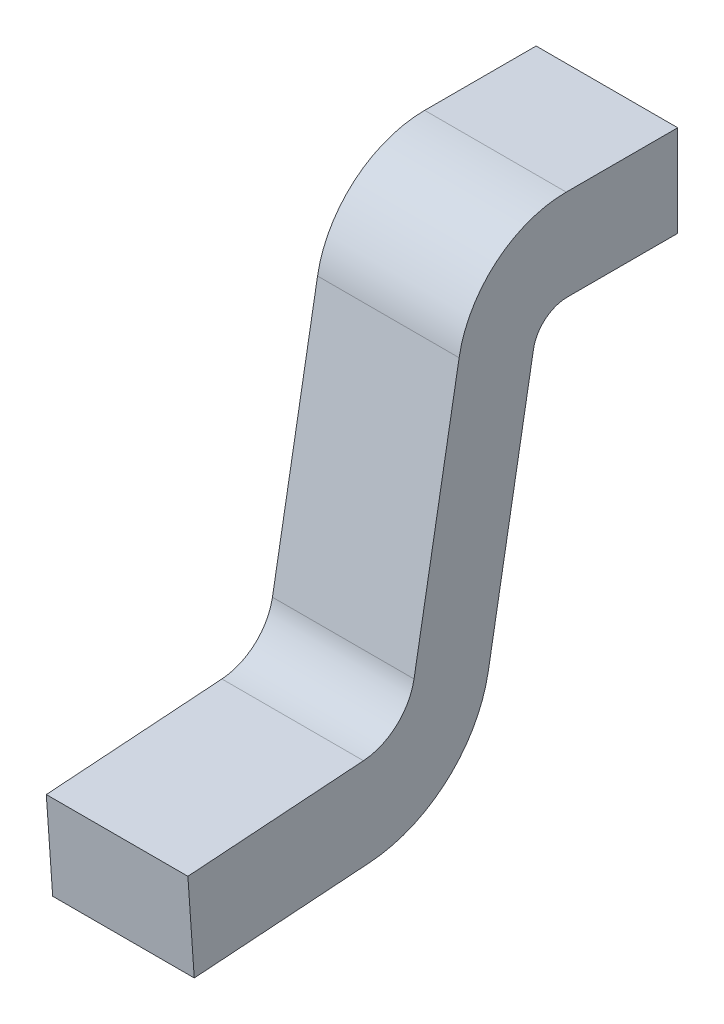
ISO-10303-21;
HEADER;
FILE_DESCRIPTION(('STEP AP214'),'2;1');
FILE_NAME('part.step','',(''),(''),'','','');
FILE_SCHEMA(('AUTOMOTIVE_DESIGN { 1 0 10303 214 1 1 1 1 }'));
ENDSEC;
DATA;
#1=APPLICATION_CONTEXT('core data for automotive mechanical design processes');
#2=APPLICATION_PROTOCOL_DEFINITION('international standard','automotive_design',2000,#1);
#3=PRODUCT_CONTEXT('',#1,'mechanical');
#4=PRODUCT('Part','Part','',(#3));
#5=PRODUCT_RELATED_PRODUCT_CATEGORY('part','',(#4));
#6=PRODUCT_DEFINITION_FORMATION('','',#4);
#7=PRODUCT_DEFINITION_CONTEXT('part definition',#1,'design');
#8=PRODUCT_DEFINITION('design','',#6,#7);
#9=PRODUCT_DEFINITION_SHAPE('','',#8);
#10=(LENGTH_UNIT() NAMED_UNIT(*) SI_UNIT(.MILLI.,.METRE.));
#11=(NAMED_UNIT(*) PLANE_ANGLE_UNIT() SI_UNIT($,.RADIAN.));
#12=(NAMED_UNIT(*) SI_UNIT($,.STERADIAN.) SOLID_ANGLE_UNIT());
#13=UNCERTAINTY_MEASURE_WITH_UNIT(LENGTH_MEASURE(1.E-05),#10,'distance_accuracy_value','');
#14=(GEOMETRIC_REPRESENTATION_CONTEXT(3) GLOBAL_UNCERTAINTY_ASSIGNED_CONTEXT((#13)) GLOBAL_UNIT_ASSIGNED_CONTEXT((#10,
#11,#12)) REPRESENTATION_CONTEXT('',''));
#15=CARTESIAN_POINT('',(0.,0.,0.));
#16=DIRECTION('',(0.,0.,1.));
#17=DIRECTION('',(1.,0.,0.));
#18=AXIS2_PLACEMENT_3D('',#15,#16,#17);
#19=CARTESIAN_POINT('',(0.205,0.,0.));
#20=DIRECTION('',(1.,0.,0.));
#21=DIRECTION('',(0.,0.,-1.));
#22=AXIS2_PLACEMENT_3D('',#19,#20,#21);
#23=PLANE('',#22);
#24=DIRECTION('',(0.,1.,0.));
#25=VECTOR('',#24,1.);
#26=CARTESIAN_POINT('',(0.205,0.6175,-0.565));
#27=LINE('',#26,#25);
#28=CARTESIAN_POINT('',(0.205,1.182378202513,-0.565));
#29=VERTEX_POINT('',#28);
#30=CARTESIAN_POINT('',(0.205,0.9175,-0.565));
#31=VERTEX_POINT('',#30);
#32=EDGE_CURVE('E126',#29,#31,#27,.F.);
#33=ORIENTED_EDGE('',*,*,#32,.F.);
#34=DIRECTION('',(0.,0.,1.));
#35=VECTOR('',#34,1.);
#36=CARTESIAN_POINT('',(0.205,1.182378202513,-0.561512176313));
#37=LINE('',#36,#35);
#38=CARTESIAN_POINT('',(0.205,1.182378202513,-0.242202144231));
#39=VERTEX_POINT('',#38);
#40=EDGE_CURVE('E131',#39,#29,#37,.F.);
#41=ORIENTED_EDGE('',*,*,#40,.F.);
#42=CARTESIAN_POINT('',(0.205,0.867378202513,-0.242202144231));
#43=DIRECTION('',(-1.,0.,0.));
#44=DIRECTION('',(0.,0.,1.));
#45=AXIS2_PLACEMENT_3D('',#42,#43,#44);
#46=CIRCLE('',#45,0.315);
#47=CARTESIAN_POINT('',(0.205,0.922077378478067,0.0680122979681178));
#48=VERTEX_POINT('',#47);
#49=EDGE_CURVE('E174',#48,#39,#46,.T.);
#50=ORIENTED_EDGE('',*,*,#49,.F.);
#51=DIRECTION('',(0.,-0.98480775301219,0.173648177667033));
#52=VECTOR('',#51,1.);
#53=CARTESIAN_POINT('',(0.205,0.08721256071138,0.215221490585));
#54=LINE('',#53,#52);
#55=CARTESIAN_POINT('',(0.205,0.181740446164169,0.198553673950206));
#56=VERTEX_POINT('',#55);
#57=EDGE_CURVE('E90',#56,#48,#54,.F.);
#58=ORIENTED_EDGE('',*,*,#57,.F.);
#59=CARTESIAN_POINT('',(0.205,0.209524154591,0.356122914432));
#60=DIRECTION('',(1.,0.,0.));
#61=DIRECTION('',(0.,0.,-1.));
#62=AXIS2_PLACEMENT_3D('',#59,#60,#61);
#63=CIRCLE('',#62,0.16);
#64=CARTESIAN_POINT('',(0.205,0.049913906549494,0.344961878632973));
#65=VERTEX_POINT('',#64);
#66=EDGE_CURVE('E20',#56,#65,#63,.F.);
#67=ORIENTED_EDGE('',*,*,#66,.T.);
#68=DIRECTION('',(0.,-0.0697564737441177,0.997564050259825));
#69=VECTOR('',#68,1.);
#70=CARTESIAN_POINT('',(0.205,0.05863386339622,0.220260685995));
#71=LINE('',#70,#69);
#72=CARTESIAN_POINT('',(0.205,0.0143544733188426,0.853485465542205));
#73=VERTEX_POINT('',#72);
#74=EDGE_CURVE('E96',#73,#65,#71,.F.);
#75=ORIENTED_EDGE('',*,*,#74,.F.);
#76=DIRECTION('',(0.,-0.997564050259825,-0.0697564737441177));
#77=VECTOR('',#76,1.);
#78=CARTESIAN_POINT('',(0.205,-0.03552372919414,0.849997641855));
#79=LINE('',#78,#77);
#80=CARTESIAN_POINT('',(0.205,-0.25,0.835000000000005));
#81=VERTEX_POINT('',#80);
#82=EDGE_CURVE('E102',#81,#73,#79,.F.);
#83=ORIENTED_EDGE('',*,*,#82,.F.);
#84=DIRECTION('',(0.,0.0697564737441177,-0.997564050259825));
#85=VECTOR('',#84,1.);
#86=CARTESIAN_POINT('',(0.205,-0.25,0.835));
#87=LINE('',#86,#85);
#88=CARTESIAN_POINT('',(0.205,-0.214440566769406,0.326476413090965));
#89=VERTEX_POINT('',#88);
#90=EDGE_CURVE('E108',#89,#81,#87,.F.);
#91=ORIENTED_EDGE('',*,*,#90,.F.);
#92=CARTESIAN_POINT('',(0.205,0.159645952078,0.352635090745));
#93=DIRECTION('',(-1.,0.,0.));
#94=DIRECTION('',(0.,0.,1.));
#95=AXIS2_PLACEMENT_3D('',#92,#93,#94);
#96=CIRCLE('',#95,0.375);
#97=CARTESIAN_POINT('',(0.205,0.0945278854528989,-0.0166678166347241));
#98=VERTEX_POINT('',#97);
#99=EDGE_CURVE('E197',#98,#89,#96,.T.);
#100=ORIENTED_EDGE('',*,*,#99,.F.);
#101=DIRECTION('',(0.,0.98480775301219,-0.173648177667033));
#102=VECTOR('',#101,1.);
#103=CARTESIAN_POINT('',(0.205,-0.19400316791,0.03420799284542));
#104=LINE('',#103,#102);
#105=CARTESIAN_POINT('',(0.205,0.834864817766876,-0.147209192616753));
#106=VERTEX_POINT('',#105);
#107=EDGE_CURVE('E194',#106,#98,#104,.F.);
#108=ORIENTED_EDGE('',*,*,#107,.F.);
#109=CARTESIAN_POINT('',(0.205,0.8175,-0.245689967918));
#110=DIRECTION('',(-1.,0.,0.));
#111=DIRECTION('',(0.,0.,1.));
#112=AXIS2_PLACEMENT_3D('',#109,#110,#111);
#113=CIRCLE('',#112,0.1);
#114=CARTESIAN_POINT('',(0.205,0.9175,-0.245689967918));
#115=VERTEX_POINT('',#114);
#116=EDGE_CURVE('E188',#106,#115,#113,.T.);
#117=ORIENTED_EDGE('',*,*,#116,.T.);
#118=DIRECTION('',(0.,0.,-1.));
#119=VECTOR('',#118,1.);
#120=CARTESIAN_POINT('',(0.205,0.9175,-0.108881910588));
#121=LINE('',#120,#119);
#122=EDGE_CURVE('E187',#31,#115,#121,.F.);
#123=ORIENTED_EDGE('',*,*,#122,.F.);
#124=EDGE_LOOP('',(#33,#41,#50,#58,#67,#75,#83,#91,#100,#108,#117,#123));
#125=FACE_BOUND('',#124,.T.);
#126=ADVANCED_FACE('F17',(#125),#23,.T.);
#127=CARTESIAN_POINT('',(-0.205,0.08721256071138,0.215221490585));
#128=DIRECTION('',(0.,0.173648177667033,0.98480775301219));
#129=DIRECTION('',(0.,-0.98480775301219,0.173648177667033));
#130=AXIS2_PLACEMENT_3D('',#127,#128,#129);
#131=PLANE('',#130);
#132=DIRECTION('',(1.,0.,0.));
#133=VECTOR('',#132,1.);
#134=CARTESIAN_POINT('',(-0.205,0.181740446164017,0.198553673950095));
#135=LINE('',#134,#133);
#136=CARTESIAN_POINT('',(-0.205,0.181740446164165,0.19855367395002));
#137=VERTEX_POINT('',#136);
#138=EDGE_CURVE('E212',#137,#56,#135,.T.);
#139=ORIENTED_EDGE('',*,*,#138,.T.);
#140=ORIENTED_EDGE('',*,*,#57,.T.);
#141=DIRECTION('',(-1.,0.,0.));
#142=VECTOR('',#141,1.);
#143=CARTESIAN_POINT('',(-0.205,0.922077378477926,0.0680122979678732));
#144=LINE('',#143,#142);
#145=CARTESIAN_POINT('',(-0.205,0.922077378478004,0.0680122979680744));
#146=VERTEX_POINT('',#145);
#147=EDGE_CURVE('E175',#146,#48,#144,.F.);
#148=ORIENTED_EDGE('',*,*,#147,.F.);
#149=DIRECTION('',(0.,-0.98480775301225,0.173648177666692));
#150=VECTOR('',#149,1.);
#151=CARTESIAN_POINT('',(-0.205,0.922077378478,0.06801229796829));
#152=LINE('',#151,#150);
#153=EDGE_CURVE('E170',#146,#137,#152,.T.);
#154=ORIENTED_EDGE('',*,*,#153,.T.);
#155=EDGE_LOOP('',(#139,#140,#148,#154));
#156=FACE_BOUND('',#155,.T.);
#157=ADVANCED_FACE('F257',(#156),#131,.T.);
#158=CARTESIAN_POINT('',(-0.205,0.209524154591,0.356122914432));
#159=DIRECTION('',(1.,0.,0.));
#160=DIRECTION('',(0.,0.,-1.));
#161=AXIS2_PLACEMENT_3D('',#158,#159,#160);
#162=CYLINDRICAL_SURFACE('',#161,0.16);
#163=ORIENTED_EDGE('',*,*,#66,.F.);
#164=ORIENTED_EDGE('',*,*,#138,.F.);
#165=CARTESIAN_POINT('',(-0.205,0.209524154591,0.356122914432));
#166=DIRECTION('',(1.,0.,0.));
#167=DIRECTION('',(0.,0.,-1.));
#168=AXIS2_PLACEMENT_3D('',#165,#166,#167);
#169=CIRCLE('',#168,0.16);
#170=CARTESIAN_POINT('',(-0.205,0.0499139065494931,0.34496187863297));
#171=VERTEX_POINT('',#170);
#172=EDGE_CURVE('E167',#137,#171,#169,.F.);
#173=ORIENTED_EDGE('',*,*,#172,.T.);
#174=DIRECTION('',(1.,0.,0.));
#175=VECTOR('',#174,1.);
#176=CARTESIAN_POINT('',(-0.205,0.0499139065494921,0.344961878633));
#177=LINE('',#176,#175);
#178=EDGE_CURVE('E210',#65,#171,#177,.F.);
#179=ORIENTED_EDGE('',*,*,#178,.F.);
#180=EDGE_LOOP('',(#163,#164,#173,#179));
#181=FACE_BOUND('',#180,.T.);
#182=ADVANCED_FACE('F255',(#181),#162,.F.);
#183=CARTESIAN_POINT('',(-0.205,0.05863386339622,0.220260685995));
#184=DIRECTION('',(0.,0.997564050259825,0.0697564737441177));
#185=DIRECTION('',(0.,-0.0697564737441177,0.997564050259825));
#186=AXIS2_PLACEMENT_3D('',#183,#184,#185);
#187=PLANE('',#186);
#188=ORIENTED_EDGE('',*,*,#74,.T.);
#189=ORIENTED_EDGE('',*,*,#178,.T.);
#190=DIRECTION('',(0.,-0.0697564737441546,0.997564050259822));
#191=VECTOR('',#190,1.);
#192=CARTESIAN_POINT('',(-0.205,0.04991390654949,0.344961878633));
#193=LINE('',#192,#191);
#194=CARTESIAN_POINT('',(-0.205,0.0143544733188452,0.853485465542068));
#195=VERTEX_POINT('',#194);
#196=EDGE_CURVE('E164',#171,#195,#193,.T.);
#197=ORIENTED_EDGE('',*,*,#196,.T.);
#198=DIRECTION('',(1.,0.,0.));
#199=VECTOR('',#198,1.);
#200=CARTESIAN_POINT('',(-0.205,0.0143544733188357,0.853485465542205));
#201=LINE('',#200,#199);
#202=EDGE_CURVE('E206',#73,#195,#201,.F.);
#203=ORIENTED_EDGE('',*,*,#202,.F.);
#204=EDGE_LOOP('',(#188,#189,#197,#203));
#205=FACE_BOUND('',#204,.T.);
#206=ADVANCED_FACE('F251',(#205),#187,.T.);
#207=CARTESIAN_POINT('',(-0.205,-0.03552372919414,0.849997641855));
#208=DIRECTION('',(0.,-0.0697564737441177,0.997564050259825));
#209=DIRECTION('',(0.,-0.997564050259825,-0.0697564737441177));
#210=AXIS2_PLACEMENT_3D('',#207,#208,#209);
#211=PLANE('',#210);
#212=ORIENTED_EDGE('',*,*,#82,.T.);
#213=ORIENTED_EDGE('',*,*,#202,.T.);
#214=DIRECTION('',(0.,-0.997564050259875,-0.0697564737434005));
#215=VECTOR('',#214,1.);
#216=CARTESIAN_POINT('',(-0.205,0.01435447331885,0.853485465542));
#217=LINE('',#216,#215);
#218=CARTESIAN_POINT('',(-0.205,-0.25,0.835));
#219=VERTEX_POINT('',#218);
#220=EDGE_CURVE('E161',#195,#219,#217,.T.);
#221=ORIENTED_EDGE('',*,*,#220,.T.);
#222=DIRECTION('',(1.,0.,0.));
#223=VECTOR('',#222,1.);
#224=CARTESIAN_POINT('',(-0.205,-0.25,0.835));
#225=LINE('',#224,#223);
#226=EDGE_CURVE('E198',#81,#219,#225,.F.);
#227=ORIENTED_EDGE('',*,*,#226,.F.);
#228=EDGE_LOOP('',(#212,#213,#221,#227));
#229=FACE_BOUND('',#228,.T.);
#230=ADVANCED_FACE('F250',(#229),#211,.T.);
#231=CARTESIAN_POINT('',(-0.205,-0.25,0.835));
#232=DIRECTION('',(0.,-0.997564050259825,-0.0697564737441177));
#233=DIRECTION('',(0.,0.0697564737441177,-0.997564050259825));
#234=AXIS2_PLACEMENT_3D('',#231,#232,#233);
#235=PLANE('',#234);
#236=ORIENTED_EDGE('',*,*,#90,.T.);
#237=ORIENTED_EDGE('',*,*,#226,.T.);
#238=DIRECTION('',(0.,0.0697564737448573,-0.997564050259773));
#239=VECTOR('',#238,1.);
#240=CARTESIAN_POINT('',(-0.205,-0.25,0.835));
#241=LINE('',#240,#239);
#242=CARTESIAN_POINT('',(-0.205,-0.214440566769207,0.326476413090839));
#243=VERTEX_POINT('',#242);
#244=EDGE_CURVE('E158',#219,#243,#241,.T.);
#245=ORIENTED_EDGE('',*,*,#244,.T.);
#246=DIRECTION('',(-1.,0.,0.));
#247=VECTOR('',#246,1.);
#248=CARTESIAN_POINT('',(-0.205,-0.214440566769435,0.32647641309097));
#249=LINE('',#248,#247);
#250=EDGE_CURVE('E195',#89,#243,#249,.T.);
#251=ORIENTED_EDGE('',*,*,#250,.F.);
#252=EDGE_LOOP('',(#236,#237,#245,#251));
#253=FACE_BOUND('',#252,.T.);
#254=ADVANCED_FACE('F245',(#253),#235,.T.);
#255=CARTESIAN_POINT('',(-0.205,0.159645952078,0.352635090745));
#256=DIRECTION('',(-1.,0.,0.));
#257=DIRECTION('',(0.,0.,1.));
#258=AXIS2_PLACEMENT_3D('',#255,#256,#257);
#259=CYLINDRICAL_SURFACE('',#258,0.375);
#260=ORIENTED_EDGE('',*,*,#250,.T.);
#261=CARTESIAN_POINT('',(-0.205,0.159645952078,0.352635090745));
#262=DIRECTION('',(-1.,0.,0.));
#263=DIRECTION('',(0.,0.,1.));
#264=AXIS2_PLACEMENT_3D('',#261,#262,#263);
#265=CIRCLE('',#264,0.375);
#266=CARTESIAN_POINT('',(-0.205,0.0945278854528215,-0.0166678166346822));
#267=VERTEX_POINT('',#266);
#268=EDGE_CURVE('E157',#243,#267,#265,.F.);
#269=ORIENTED_EDGE('',*,*,#268,.T.);
#270=DIRECTION('',(1.,0.,0.));
#271=VECTOR('',#270,1.);
#272=CARTESIAN_POINT('',(-0.205,0.0945278854529604,-0.0166678166347349));
#273=LINE('',#272,#271);
#274=EDGE_CURVE('E192',#98,#267,#273,.F.);
#275=ORIENTED_EDGE('',*,*,#274,.F.);
#276=ORIENTED_EDGE('',*,*,#99,.T.);
#277=EDGE_LOOP('',(#260,#269,#275,#276));
#278=FACE_BOUND('',#277,.T.);
#279=ADVANCED_FACE('F243',(#278),#259,.T.);
#280=CARTESIAN_POINT('',(-0.205,-0.19400316791,0.03420799284542));
#281=DIRECTION('',(0.,-0.173648177667033,-0.98480775301219));
#282=DIRECTION('',(0.,0.98480775301219,-0.173648177667033));
#283=AXIS2_PLACEMENT_3D('',#280,#281,#282);
#284=PLANE('',#283);
#285=ORIENTED_EDGE('',*,*,#274,.T.);
#286=DIRECTION('',(0.,0.984807753012113,-0.173648177667472));
#287=VECTOR('',#286,1.);
#288=CARTESIAN_POINT('',(-0.205,0.09452788545297,-0.01666781663468));
#289=LINE('',#288,#287);
#290=CARTESIAN_POINT('',(-0.205,0.834864817766874,-0.147209192616894));
#291=VERTEX_POINT('',#290);
#292=EDGE_CURVE('E147',#267,#291,#289,.T.);
#293=ORIENTED_EDGE('',*,*,#292,.T.);
#294=DIRECTION('',(-1.,0.,0.));
#295=VECTOR('',#294,1.);
#296=CARTESIAN_POINT('',(-0.205,0.834864817767028,-0.147209192616838));
#297=LINE('',#296,#295);
#298=EDGE_CURVE('E189',#291,#106,#297,.F.);
#299=ORIENTED_EDGE('',*,*,#298,.T.);
#300=ORIENTED_EDGE('',*,*,#107,.T.);
#301=EDGE_LOOP('',(#285,#293,#299,#300));
#302=FACE_BOUND('',#301,.T.);
#303=ADVANCED_FACE('F266',(#302),#284,.T.);
#304=CARTESIAN_POINT('',(-0.205,0.8175,-0.245689967918));
#305=DIRECTION('',(-1.,0.,0.));
#306=DIRECTION('',(0.,0.,1.));
#307=AXIS2_PLACEMENT_3D('',#304,#305,#306);
#308=CYLINDRICAL_SURFACE('',#307,0.1);
#309=ORIENTED_EDGE('',*,*,#298,.F.);
#310=CARTESIAN_POINT('',(-0.205,0.8175,-0.245689967918));
#311=DIRECTION('',(-1.,0.,0.));
#312=DIRECTION('',(0.,0.,1.));
#313=AXIS2_PLACEMENT_3D('',#310,#311,#312);
#314=CIRCLE('',#313,0.1);
#315=CARTESIAN_POINT('',(-0.205,0.9175,-0.245689967918));
#316=VERTEX_POINT('',#315);
#317=EDGE_CURVE('E145',#291,#316,#314,.T.);
#318=ORIENTED_EDGE('',*,*,#317,.T.);
#319=DIRECTION('',(1.,0.,0.));
#320=VECTOR('',#319,1.);
#321=CARTESIAN_POINT('',(-0.205,0.9175,-0.245689967918));
#322=LINE('',#321,#320);
#323=EDGE_CURVE('E144',#115,#316,#322,.F.);
#324=ORIENTED_EDGE('',*,*,#323,.F.);
#325=ORIENTED_EDGE('',*,*,#116,.F.);
#326=EDGE_LOOP('',(#309,#318,#324,#325));
#327=FACE_BOUND('',#326,.T.);
#328=ADVANCED_FACE('F264',(#327),#308,.F.);
#329=CARTESIAN_POINT('',(-0.205,0.9175,-0.108881910588));
#330=DIRECTION('',(0.,-1.,0.));
#331=DIRECTION('',(0.,0.,-1.));
#332=AXIS2_PLACEMENT_3D('',#329,#330,#331);
#333=PLANE('',#332);
#334=DIRECTION('',(-1.,0.,0.));
#335=VECTOR('',#334,1.);
#336=CARTESIAN_POINT('',(-0.205,0.9175,-0.565));
#337=LINE('',#336,#335);
#338=CARTESIAN_POINT('',(-0.205,0.9175,-0.565));
#339=VERTEX_POINT('',#338);
#340=EDGE_CURVE('E120',#31,#339,#337,.T.);
#341=ORIENTED_EDGE('',*,*,#340,.F.);
#342=ORIENTED_EDGE('',*,*,#122,.T.);
#343=ORIENTED_EDGE('',*,*,#323,.T.);
#344=DIRECTION('',(0.,0.,-1.));
#345=VECTOR('',#344,1.);
#346=CARTESIAN_POINT('',(-0.205,0.9175,0.));
#347=LINE('',#346,#345);
#348=EDGE_CURVE('E138',#316,#339,#347,.T.);
#349=ORIENTED_EDGE('',*,*,#348,.T.);
#350=EDGE_LOOP('',(#341,#342,#343,#349));
#351=FACE_BOUND('',#350,.T.);
#352=ADVANCED_FACE('F142',(#351),#333,.T.);
#353=CARTESIAN_POINT('',(-0.205,0.6175,-0.565));
#354=DIRECTION('',(0.,0.,-1.));
#355=DIRECTION('',(-1.,0.,0.));
#356=AXIS2_PLACEMENT_3D('',#353,#354,#355);
#357=PLANE('',#356);
#358=ORIENTED_EDGE('',*,*,#32,.T.);
#359=ORIENTED_EDGE('',*,*,#340,.T.);
#360=DIRECTION('',(0.,1.,0.));
#361=VECTOR('',#360,1.);
#362=CARTESIAN_POINT('',(-0.205,0.,-0.565));
#363=LINE('',#362,#361);
#364=CARTESIAN_POINT('',(-0.205,1.182378202513,-0.565));
#365=VERTEX_POINT('',#364);
#366=EDGE_CURVE('E124',#339,#365,#363,.T.);
#367=ORIENTED_EDGE('',*,*,#366,.T.);
#368=DIRECTION('',(1.,0.,0.));
#369=VECTOR('',#368,1.);
#370=CARTESIAN_POINT('',(-0.205,1.182378202513,-0.565));
#371=LINE('',#370,#369);
#372=EDGE_CURVE('E178',#29,#365,#371,.F.);
#373=ORIENTED_EDGE('',*,*,#372,.F.);
#374=EDGE_LOOP('',(#358,#359,#367,#373));
#375=FACE_BOUND('',#374,.T.);
#376=ADVANCED_FACE('F122',(#375),#357,.T.);
#377=CARTESIAN_POINT('',(-0.205,1.182378202513,-0.561512176313));
#378=DIRECTION('',(0.,1.,0.));
#379=DIRECTION('',(0.,0.,1.));
#380=AXIS2_PLACEMENT_3D('',#377,#378,#379);
#381=PLANE('',#380);
#382=ORIENTED_EDGE('',*,*,#372,.T.);
#383=DIRECTION('',(0.,0.,-1.));
#384=VECTOR('',#383,1.);
#385=CARTESIAN_POINT('',(-0.205,1.182378202513,0.));
#386=LINE('',#385,#384);
#387=CARTESIAN_POINT('',(-0.205,1.182378202513,-0.242202144231));
#388=VERTEX_POINT('',#387);
#389=EDGE_CURVE('E26',#365,#388,#386,.F.);
#390=ORIENTED_EDGE('',*,*,#389,.T.);
#391=DIRECTION('',(-1.,0.,0.));
#392=VECTOR('',#391,1.);
#393=CARTESIAN_POINT('',(-0.205,1.182378202513,-0.242202144231));
#394=LINE('',#393,#392);
#395=EDGE_CURVE('E34',#39,#388,#394,.T.);
#396=ORIENTED_EDGE('',*,*,#395,.F.);
#397=ORIENTED_EDGE('',*,*,#40,.T.);
#398=EDGE_LOOP('',(#382,#390,#396,#397));
#399=FACE_BOUND('',#398,.T.);
#400=ADVANCED_FACE('F260',(#399),#381,.T.);
#401=CARTESIAN_POINT('',(-0.205,0.867378202513,-0.242202144231));
#402=DIRECTION('',(-1.,0.,0.));
#403=DIRECTION('',(0.,0.,1.));
#404=AXIS2_PLACEMENT_3D('',#401,#402,#403);
#405=CYLINDRICAL_SURFACE('',#404,0.315);
#406=ORIENTED_EDGE('',*,*,#49,.T.);
#407=ORIENTED_EDGE('',*,*,#395,.T.);
#408=CARTESIAN_POINT('',(-0.205,0.867378202513,-0.242202144231));
#409=DIRECTION('',(-1.,0.,0.));
#410=DIRECTION('',(0.,0.,1.));
#411=AXIS2_PLACEMENT_3D('',#408,#409,#410);
#412=CIRCLE('',#411,0.315);
#413=EDGE_CURVE('E11',#388,#146,#412,.F.);
#414=ORIENTED_EDGE('',*,*,#413,.T.);
#415=ORIENTED_EDGE('',*,*,#147,.T.);
#416=EDGE_LOOP('',(#406,#407,#414,#415));
#417=FACE_BOUND('',#416,.T.);
#418=ADVANCED_FACE('F277',(#417),#405,.T.);
#419=CARTESIAN_POINT('',(-0.205,0.,0.));
#420=DIRECTION('',(1.,0.,0.));
#421=DIRECTION('',(0.,0.,-1.));
#422=AXIS2_PLACEMENT_3D('',#419,#420,#421);
#423=PLANE('',#422);
#424=ORIENTED_EDGE('',*,*,#389,.F.);
#425=ORIENTED_EDGE('',*,*,#366,.F.);
#426=ORIENTED_EDGE('',*,*,#348,.F.);
#427=ORIENTED_EDGE('',*,*,#317,.F.);
#428=ORIENTED_EDGE('',*,*,#292,.F.);
#429=ORIENTED_EDGE('',*,*,#268,.F.);
#430=ORIENTED_EDGE('',*,*,#244,.F.);
#431=ORIENTED_EDGE('',*,*,#220,.F.);
#432=ORIENTED_EDGE('',*,*,#196,.F.);
#433=ORIENTED_EDGE('',*,*,#172,.F.);
#434=ORIENTED_EDGE('',*,*,#153,.F.);
#435=ORIENTED_EDGE('',*,*,#413,.F.);
#436=EDGE_LOOP('',(#424,#425,#426,#427,#428,#429,#430,#431,#432,#433,#434,#435));
#437=FACE_BOUND('',#436,.T.);
#438=ADVANCED_FACE('F136',(#437),#423,.F.);
#439=CLOSED_SHELL('',(#126,#157,#182,#206,#230,#254,#279,#303,#328,#352,#376,#400,#418,#438));
#440=MANIFOLD_SOLID_BREP('B1',#439);
#441=ADVANCED_BREP_SHAPE_REPRESENTATION('',(#18,#440),#14);
#442=SHAPE_DEFINITION_REPRESENTATION(#9,#441);
ENDSEC;
END-ISO-10303-21;
